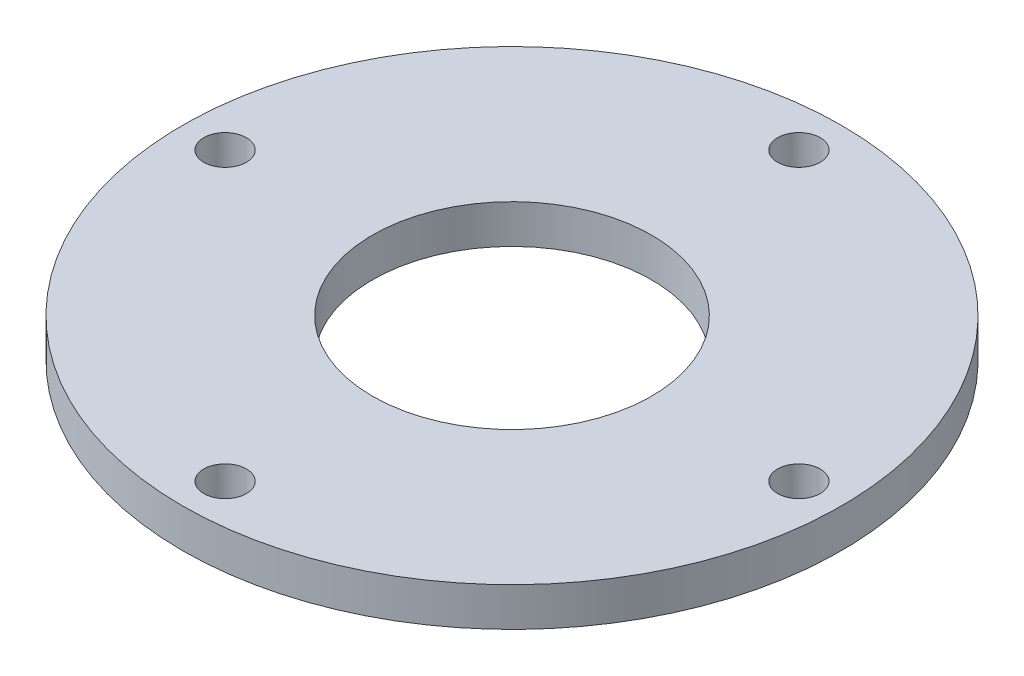
ISO-10303-21;
HEADER;
FILE_DESCRIPTION(('STEP AP214'),'2;1');
FILE_NAME('part.step','',(''),(''),'','','');
FILE_SCHEMA(('AUTOMOTIVE_DESIGN { 1 0 10303 214 1 1 1 1 }'));
ENDSEC;
DATA;
#1=APPLICATION_CONTEXT('core data for automotive mechanical design processes');
#2=APPLICATION_PROTOCOL_DEFINITION('international standard','automotive_design',2000,#1);
#3=PRODUCT_CONTEXT('',#1,'mechanical');
#4=PRODUCT('Part','Part','',(#3));
#5=PRODUCT_RELATED_PRODUCT_CATEGORY('part','',(#4));
#6=PRODUCT_DEFINITION_FORMATION('','',#4);
#7=PRODUCT_DEFINITION_CONTEXT('part definition',#1,'design');
#8=PRODUCT_DEFINITION('design','',#6,#7);
#9=PRODUCT_DEFINITION_SHAPE('','',#8);
#10=(LENGTH_UNIT() NAMED_UNIT(*) SI_UNIT(.MILLI.,.METRE.));
#11=(NAMED_UNIT(*) PLANE_ANGLE_UNIT() SI_UNIT($,.RADIAN.));
#12=(NAMED_UNIT(*) SI_UNIT($,.STERADIAN.) SOLID_ANGLE_UNIT());
#13=UNCERTAINTY_MEASURE_WITH_UNIT(LENGTH_MEASURE(1.E-05),#10,'distance_accuracy_value','');
#14=(GEOMETRIC_REPRESENTATION_CONTEXT(3) GLOBAL_UNCERTAINTY_ASSIGNED_CONTEXT((#13)) GLOBAL_UNIT_ASSIGNED_CONTEXT((#10,
#11,#12)) REPRESENTATION_CONTEXT('',''));
#15=CARTESIAN_POINT('',(0.,0.,0.));
#16=DIRECTION('',(0.,0.,1.));
#17=DIRECTION('',(1.,0.,0.));
#18=AXIS2_PLACEMENT_3D('',#15,#16,#17);
#19=CARTESIAN_POINT('',(0.,0.,0.));
#20=DIRECTION('',(0.,1.,0.));
#21=DIRECTION('',(0.,0.,1.));
#22=AXIS2_PLACEMENT_3D('',#19,#20,#21);
#23=CYLINDRICAL_SURFACE('',#22,18.);
#24=CARTESIAN_POINT('',(0.,2.5,0.));
#25=DIRECTION('',(0.,1.,0.));
#26=DIRECTION('',(0.,0.,1.));
#27=AXIS2_PLACEMENT_3D('',#24,#25,#26);
#28=CIRCLE('',#27,18.);
#29=CARTESIAN_POINT('',(0.,2.5,18.));
#30=VERTEX_POINT('',#29);
#31=EDGE_CURVE('E10',#30,#30,#28,.T.);
#32=ORIENTED_EDGE('',*,*,#31,.T.);
#33=EDGE_LOOP('',(#32));
#34=FACE_BOUND('',#33,.T.);
#35=CARTESIAN_POINT('',(0.,-2.5,0.));
#36=DIRECTION('',(0.,1.,0.));
#37=DIRECTION('',(0.,0.,1.));
#38=AXIS2_PLACEMENT_3D('',#35,#36,#37);
#39=CIRCLE('',#38,18.);
#40=CARTESIAN_POINT('',(0.,-2.5,18.));
#41=VERTEX_POINT('',#40);
#42=EDGE_CURVE('E62',#41,#41,#39,.T.);
#43=ORIENTED_EDGE('',*,*,#42,.F.);
#44=EDGE_LOOP('',(#43));
#45=FACE_BOUND('',#44,.T.);
#46=ADVANCED_FACE('F34',(#34,#45),#23,.F.);
#47=CARTESIAN_POINT('',(-18.,2.5,0.));
#48=DIRECTION('',(0.,1.,0.));
#49=DIRECTION('',(0.,0.,1.));
#50=AXIS2_PLACEMENT_3D('',#47,#48,#49);
#51=PLANE('',#50);
#52=CARTESIAN_POINT('',(3.87554428611588E-13,2.5,-37.));
#53=DIRECTION('',(0.,1.,0.));
#54=DIRECTION('',(0.,0.,1.));
#55=AXIS2_PLACEMENT_3D('',#52,#53,#54);
#56=CIRCLE('',#55,2.75);
#57=CARTESIAN_POINT('',(3.87554428611588E-13,2.5,-34.25));
#58=VERTEX_POINT('',#57);
#59=EDGE_CURVE('E83',#58,#58,#56,.T.);
#60=ORIENTED_EDGE('',*,*,#59,.F.);
#61=EDGE_LOOP('',(#60));
#62=FACE_BOUND('',#61,.T.);
#63=CARTESIAN_POINT('',(-37.,2.5,0.));
#64=DIRECTION('',(0.,1.,0.));
#65=DIRECTION('',(0.,0.,1.));
#66=AXIS2_PLACEMENT_3D('',#63,#64,#65);
#67=CIRCLE('',#66,2.75);
#68=CARTESIAN_POINT('',(-37.,2.5,2.75));
#69=VERTEX_POINT('',#68);
#70=EDGE_CURVE('E77',#69,#69,#67,.T.);
#71=ORIENTED_EDGE('',*,*,#70,.F.);
#72=EDGE_LOOP('',(#71));
#73=FACE_BOUND('',#72,.T.);
#74=CARTESIAN_POINT('',(-1.29184809537196E-13,2.5,37.));
#75=DIRECTION('',(0.,1.,0.));
#76=DIRECTION('',(0.,0.,1.));
#77=AXIS2_PLACEMENT_3D('',#74,#75,#76);
#78=CIRCLE('',#77,2.75);
#79=CARTESIAN_POINT('',(-1.29184809537196E-13,2.5,39.75));
#80=VERTEX_POINT('',#79);
#81=EDGE_CURVE('E74',#80,#80,#78,.T.);
#82=ORIENTED_EDGE('',*,*,#81,.F.);
#83=EDGE_LOOP('',(#82));
#84=FACE_BOUND('',#83,.T.);
#85=CARTESIAN_POINT('',(37.,2.5,0.));
#86=DIRECTION('',(0.,1.,0.));
#87=DIRECTION('',(0.,0.,1.));
#88=AXIS2_PLACEMENT_3D('',#85,#86,#87);
#89=CIRCLE('',#88,2.75);
#90=CARTESIAN_POINT('',(37.,2.5,2.75));
#91=VERTEX_POINT('',#90);
#92=EDGE_CURVE('E68',#91,#91,#89,.T.);
#93=ORIENTED_EDGE('',*,*,#92,.F.);
#94=EDGE_LOOP('',(#93));
#95=FACE_BOUND('',#94,.T.);
#96=CARTESIAN_POINT('',(0.,2.5,0.));
#97=DIRECTION('',(0.,1.,0.));
#98=DIRECTION('',(0.,0.,1.));
#99=AXIS2_PLACEMENT_3D('',#96,#97,#98);
#100=CIRCLE('',#99,42.5);
#101=CARTESIAN_POINT('',(0.,2.5,42.5));
#102=VERTEX_POINT('',#101);
#103=EDGE_CURVE('E41',#102,#102,#100,.T.);
#104=ORIENTED_EDGE('',*,*,#103,.T.);
#105=EDGE_LOOP('',(#104));
#106=FACE_BOUND('',#105,.T.);
#107=ORIENTED_EDGE('',*,*,#31,.F.);
#108=EDGE_LOOP('',(#107));
#109=FACE_BOUND('',#108,.T.);
#110=ADVANCED_FACE('F89',(#62,#73,#84,#95,#106,#109),#51,.T.);
#111=CARTESIAN_POINT('',(0.,0.,0.));
#112=DIRECTION('',(0.,1.,0.));
#113=DIRECTION('',(0.,0.,1.));
#114=AXIS2_PLACEMENT_3D('',#111,#112,#113);
#115=CYLINDRICAL_SURFACE('',#114,42.5);
#116=CARTESIAN_POINT('',(0.,-2.5,0.));
#117=DIRECTION('',(0.,1.,0.));
#118=DIRECTION('',(0.,0.,1.));
#119=AXIS2_PLACEMENT_3D('',#116,#117,#118);
#120=CIRCLE('',#119,42.5);
#121=CARTESIAN_POINT('',(0.,-2.5,42.5));
#122=VERTEX_POINT('',#121);
#123=EDGE_CURVE('E45',#122,#122,#120,.T.);
#124=ORIENTED_EDGE('',*,*,#123,.T.);
#125=EDGE_LOOP('',(#124));
#126=FACE_BOUND('',#125,.T.);
#127=ORIENTED_EDGE('',*,*,#103,.F.);
#128=EDGE_LOOP('',(#127));
#129=FACE_BOUND('',#128,.T.);
#130=ADVANCED_FACE('F92',(#126,#129),#115,.T.);
#131=CARTESIAN_POINT('',(-42.5,-2.5,0.));
#132=DIRECTION('',(0.,-1.,0.));
#133=DIRECTION('',(0.,0.,-1.));
#134=AXIS2_PLACEMENT_3D('',#131,#132,#133);
#135=PLANE('',#134);
#136=CARTESIAN_POINT('',(3.87554428611588E-13,-2.5,-37.));
#137=DIRECTION('',(0.,-1.,0.));
#138=DIRECTION('',(0.,0.,-1.));
#139=AXIS2_PLACEMENT_3D('',#136,#137,#138);
#140=CIRCLE('',#139,2.75);
#141=CARTESIAN_POINT('',(3.87554428611588E-13,-2.5,-39.75));
#142=VERTEX_POINT('',#141);
#143=EDGE_CURVE('E80',#142,#142,#140,.T.);
#144=ORIENTED_EDGE('',*,*,#143,.F.);
#145=EDGE_LOOP('',(#144));
#146=FACE_BOUND('',#145,.T.);
#147=CARTESIAN_POINT('',(-37.,-2.5,0.));
#148=DIRECTION('',(0.,-1.,0.));
#149=DIRECTION('',(0.,0.,-1.));
#150=AXIS2_PLACEMENT_3D('',#147,#148,#149);
#151=CIRCLE('',#150,2.75);
#152=CARTESIAN_POINT('',(-37.,-2.5,-2.75));
#153=VERTEX_POINT('',#152);
#154=EDGE_CURVE('E37',#153,#153,#151,.T.);
#155=ORIENTED_EDGE('',*,*,#154,.F.);
#156=EDGE_LOOP('',(#155));
#157=FACE_BOUND('',#156,.T.);
#158=CARTESIAN_POINT('',(-1.29184809537196E-13,-2.5,37.));
#159=DIRECTION('',(0.,-1.,0.));
#160=DIRECTION('',(0.,0.,-1.));
#161=AXIS2_PLACEMENT_3D('',#158,#159,#160);
#162=CIRCLE('',#161,2.75);
#163=CARTESIAN_POINT('',(-1.29184809537196E-13,-2.5,34.25));
#164=VERTEX_POINT('',#163);
#165=EDGE_CURVE('E71',#164,#164,#162,.T.);
#166=ORIENTED_EDGE('',*,*,#165,.F.);
#167=EDGE_LOOP('',(#166));
#168=FACE_BOUND('',#167,.T.);
#169=CARTESIAN_POINT('',(37.,-2.5,0.));
#170=DIRECTION('',(0.,-1.,0.));
#171=DIRECTION('',(0.,0.,-1.));
#172=AXIS2_PLACEMENT_3D('',#169,#170,#171);
#173=CIRCLE('',#172,2.75);
#174=CARTESIAN_POINT('',(37.,-2.5,-2.75));
#175=VERTEX_POINT('',#174);
#176=EDGE_CURVE('E65',#175,#175,#173,.T.);
#177=ORIENTED_EDGE('',*,*,#176,.F.);
#178=EDGE_LOOP('',(#177));
#179=FACE_BOUND('',#178,.T.);
#180=CARTESIAN_POINT('',(0.,-2.5,0.));
#181=DIRECTION('',(0.,1.,0.));
#182=DIRECTION('',(0.,0.,1.));
#183=AXIS2_PLACEMENT_3D('',#180,#181,#182);
#184=CIRCLE('',#183,31.);
#185=CARTESIAN_POINT('',(0.,-2.5,31.));
#186=VERTEX_POINT('',#185);
#187=EDGE_CURVE('E50',#186,#186,#184,.T.);
#188=ORIENTED_EDGE('',*,*,#187,.T.);
#189=EDGE_LOOP('',(#188));
#190=FACE_BOUND('',#189,.T.);
#191=ORIENTED_EDGE('',*,*,#123,.F.);
#192=EDGE_LOOP('',(#191));
#193=FACE_BOUND('',#192,.T.);
#194=ADVANCED_FACE('F103',(#146,#157,#168,#179,#190,#193),#135,.T.);
#195=CARTESIAN_POINT('',(0.,0.,0.));
#196=DIRECTION('',(0.,1.,0.));
#197=DIRECTION('',(0.,0.,1.));
#198=AXIS2_PLACEMENT_3D('',#195,#196,#197);
#199=CYLINDRICAL_SURFACE('',#198,31.);
#200=CARTESIAN_POINT('',(0.,-5.50000000000001,0.));
#201=DIRECTION('',(0.,1.,0.));
#202=DIRECTION('',(0.,0.,1.));
#203=AXIS2_PLACEMENT_3D('',#200,#201,#202);
#204=CIRCLE('',#203,31.);
#205=CARTESIAN_POINT('',(0.,-5.50000000000001,31.));
#206=VERTEX_POINT('',#205);
#207=EDGE_CURVE('E53',#206,#206,#204,.T.);
#208=ORIENTED_EDGE('',*,*,#207,.T.);
#209=EDGE_LOOP('',(#208));
#210=FACE_BOUND('',#209,.T.);
#211=ORIENTED_EDGE('',*,*,#187,.F.);
#212=EDGE_LOOP('',(#211));
#213=FACE_BOUND('',#212,.T.);
#214=ADVANCED_FACE('F109',(#210,#213),#199,.T.);
#215=CARTESIAN_POINT('',(-31.,-5.50000000000001,0.));
#216=DIRECTION('',(0.,-1.,0.));
#217=DIRECTION('',(0.,0.,-1.));
#218=AXIS2_PLACEMENT_3D('',#215,#216,#217);
#219=PLANE('',#218);
#220=CARTESIAN_POINT('',(0.,-5.50000000000001,0.));
#221=DIRECTION('',(0.,1.,0.));
#222=DIRECTION('',(0.,0.,1.));
#223=AXIS2_PLACEMENT_3D('',#220,#221,#222);
#224=CIRCLE('',#223,26.);
#225=CARTESIAN_POINT('',(0.,-5.50000000000001,26.));
#226=VERTEX_POINT('',#225);
#227=EDGE_CURVE('E56',#226,#226,#224,.T.);
#228=ORIENTED_EDGE('',*,*,#227,.T.);
#229=EDGE_LOOP('',(#228));
#230=FACE_BOUND('',#229,.T.);
#231=ORIENTED_EDGE('',*,*,#207,.F.);
#232=EDGE_LOOP('',(#231));
#233=FACE_BOUND('',#232,.T.);
#234=ADVANCED_FACE('F128',(#230,#233),#219,.T.);
#235=CARTESIAN_POINT('',(0.,0.,0.));
#236=DIRECTION('',(0.,1.,0.));
#237=DIRECTION('',(0.,0.,1.));
#238=AXIS2_PLACEMENT_3D('',#235,#236,#237);
#239=CYLINDRICAL_SURFACE('',#238,26.);
#240=CARTESIAN_POINT('',(0.,-2.5,0.));
#241=DIRECTION('',(0.,1.,0.));
#242=DIRECTION('',(0.,0.,1.));
#243=AXIS2_PLACEMENT_3D('',#240,#241,#242);
#244=CIRCLE('',#243,26.);
#245=CARTESIAN_POINT('',(0.,-2.5,26.));
#246=VERTEX_POINT('',#245);
#247=EDGE_CURVE('E59',#246,#246,#244,.T.);
#248=ORIENTED_EDGE('',*,*,#247,.T.);
#249=EDGE_LOOP('',(#248));
#250=FACE_BOUND('',#249,.T.);
#251=ORIENTED_EDGE('',*,*,#227,.F.);
#252=EDGE_LOOP('',(#251));
#253=FACE_BOUND('',#252,.T.);
#254=ADVANCED_FACE('F122',(#250,#253),#239,.F.);
#255=CARTESIAN_POINT('',(-26.,-2.5,0.));
#256=DIRECTION('',(0.,-1.,0.));
#257=DIRECTION('',(0.,0.,-1.));
#258=AXIS2_PLACEMENT_3D('',#255,#256,#257);
#259=PLANE('',#258);
#260=ORIENTED_EDGE('',*,*,#42,.T.);
#261=EDGE_LOOP('',(#260));
#262=FACE_BOUND('',#261,.T.);
#263=ORIENTED_EDGE('',*,*,#247,.F.);
#264=EDGE_LOOP('',(#263));
#265=FACE_BOUND('',#264,.T.);
#266=ADVANCED_FACE('F118',(#262,#265),#259,.T.);
#267=CARTESIAN_POINT('',(37.,2.5,0.));
#268=DIRECTION('',(0.,1.,0.));
#269=DIRECTION('',(0.,0.,1.));
#270=AXIS2_PLACEMENT_3D('',#267,#268,#269);
#271=CYLINDRICAL_SURFACE('',#270,2.75);
#272=ORIENTED_EDGE('',*,*,#176,.T.);
#273=EDGE_LOOP('',(#272));
#274=FACE_BOUND('',#273,.T.);
#275=ORIENTED_EDGE('',*,*,#92,.T.);
#276=EDGE_LOOP('',(#275));
#277=FACE_BOUND('',#276,.T.);
#278=ADVANCED_FACE('F121',(#274,#277),#271,.F.);
#279=CARTESIAN_POINT('',(-1.29184809537196E-13,2.5,37.));
#280=DIRECTION('',(0.,1.,0.));
#281=DIRECTION('',(0.,0.,1.));
#282=AXIS2_PLACEMENT_3D('',#279,#280,#281);
#283=CYLINDRICAL_SURFACE('',#282,2.75);
#284=ORIENTED_EDGE('',*,*,#165,.T.);
#285=EDGE_LOOP('',(#284));
#286=FACE_BOUND('',#285,.T.);
#287=ORIENTED_EDGE('',*,*,#81,.T.);
#288=EDGE_LOOP('',(#287));
#289=FACE_BOUND('',#288,.T.);
#290=ADVANCED_FACE('F149',(#286,#289),#283,.F.);
#291=CARTESIAN_POINT('',(-37.,2.5,0.));
#292=DIRECTION('',(0.,1.,0.));
#293=DIRECTION('',(0.,0.,1.));
#294=AXIS2_PLACEMENT_3D('',#291,#292,#293);
#295=CYLINDRICAL_SURFACE('',#294,2.75);
#296=ORIENTED_EDGE('',*,*,#154,.T.);
#297=EDGE_LOOP('',(#296));
#298=FACE_BOUND('',#297,.T.);
#299=ORIENTED_EDGE('',*,*,#70,.T.);
#300=EDGE_LOOP('',(#299));
#301=FACE_BOUND('',#300,.T.);
#302=ADVANCED_FACE('F153',(#298,#301),#295,.F.);
#303=CARTESIAN_POINT('',(3.87554428611588E-13,2.5,-37.));
#304=DIRECTION('',(0.,1.,0.));
#305=DIRECTION('',(0.,0.,1.));
#306=AXIS2_PLACEMENT_3D('',#303,#304,#305);
#307=CYLINDRICAL_SURFACE('',#306,2.75);
#308=ORIENTED_EDGE('',*,*,#143,.T.);
#309=EDGE_LOOP('',(#308));
#310=FACE_BOUND('',#309,.T.);
#311=ORIENTED_EDGE('',*,*,#59,.T.);
#312=EDGE_LOOP('',(#311));
#313=FACE_BOUND('',#312,.T.);
#314=ADVANCED_FACE('F87',(#310,#313),#307,.F.);
#315=CLOSED_SHELL('',(#46,#110,#130,#194,#214,#234,#254,#266,#278,#290,#302,#314));
#316=MANIFOLD_SOLID_BREP('B2',#315);
#317=ADVANCED_BREP_SHAPE_REPRESENTATION('',(#18,#316),#14);
#318=SHAPE_DEFINITION_REPRESENTATION(#9,#317);
ENDSEC;
END-ISO-10303-21;
